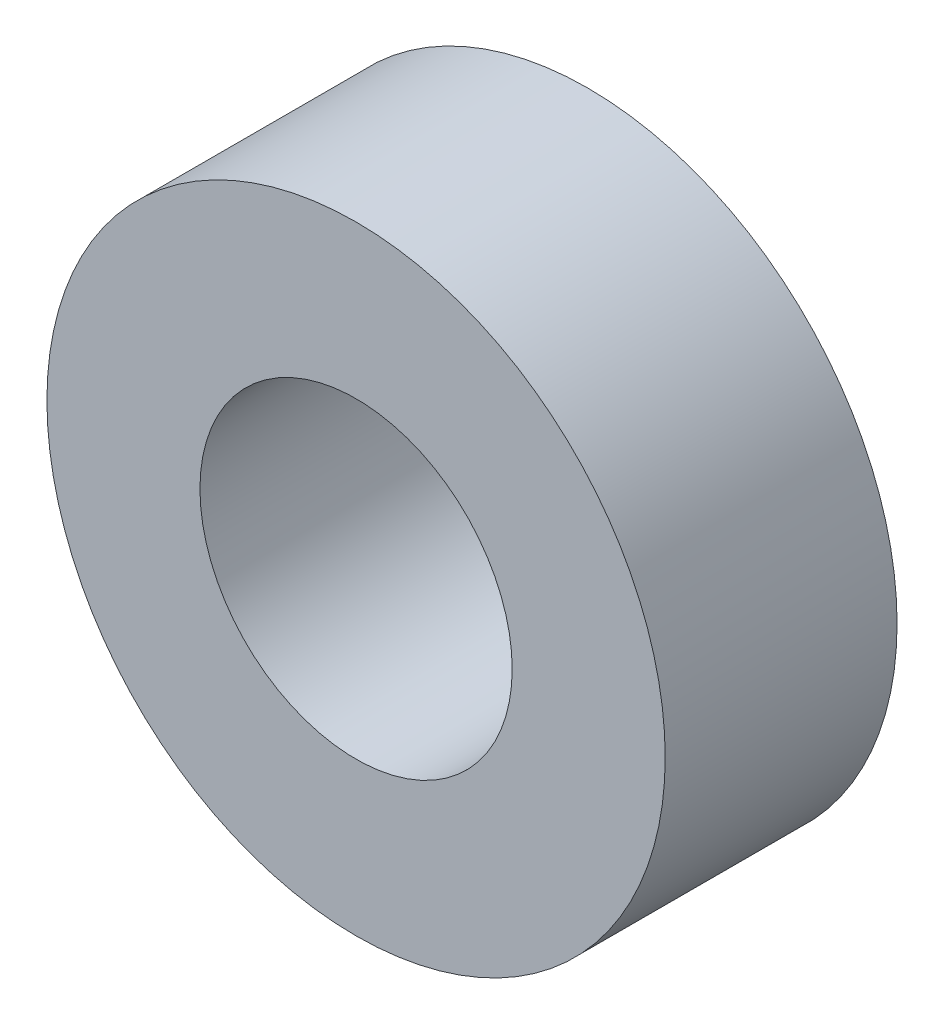
ISO-10303-21;
HEADER;
FILE_DESCRIPTION(('STEP AP214'),'2;1');
FILE_NAME('part.step','',(''),(''),'','','');
FILE_SCHEMA(('AUTOMOTIVE_DESIGN { 1 0 10303 214 1 1 1 1 }'));
ENDSEC;
DATA;
#1=APPLICATION_CONTEXT('core data for automotive mechanical design processes');
#2=APPLICATION_PROTOCOL_DEFINITION('international standard','automotive_design',2000,#1);
#3=PRODUCT_CONTEXT('',#1,'mechanical');
#4=PRODUCT('Part','Part','',(#3));
#5=PRODUCT_RELATED_PRODUCT_CATEGORY('part','',(#4));
#6=PRODUCT_DEFINITION_FORMATION('','',#4);
#7=PRODUCT_DEFINITION_CONTEXT('part definition',#1,'design');
#8=PRODUCT_DEFINITION('design','',#6,#7);
#9=PRODUCT_DEFINITION_SHAPE('','',#8);
#10=(LENGTH_UNIT() NAMED_UNIT(*) SI_UNIT(.MILLI.,.METRE.));
#11=(NAMED_UNIT(*) PLANE_ANGLE_UNIT() SI_UNIT($,.RADIAN.));
#12=(NAMED_UNIT(*) SI_UNIT($,.STERADIAN.) SOLID_ANGLE_UNIT());
#13=UNCERTAINTY_MEASURE_WITH_UNIT(LENGTH_MEASURE(1.E-05),#10,'distance_accuracy_value','');
#14=(GEOMETRIC_REPRESENTATION_CONTEXT(3) GLOBAL_UNCERTAINTY_ASSIGNED_CONTEXT((#13)) GLOBAL_UNIT_ASSIGNED_CONTEXT((#10,
#11,#12)) REPRESENTATION_CONTEXT('',''));
#15=CARTESIAN_POINT('',(0.,0.,0.));
#16=DIRECTION('',(0.,0.,1.));
#17=DIRECTION('',(1.,0.,0.));
#18=AXIS2_PLACEMENT_3D('',#15,#16,#17);
#19=CARTESIAN_POINT('',(0.,0.,4.7625));
#20=DIRECTION('',(0.,0.,1.));
#21=DIRECTION('',(1.,0.,0.));
#22=AXIS2_PLACEMENT_3D('',#19,#20,#21);
#23=PLANE('',#22);
#24=CARTESIAN_POINT('',(0.,0.,4.7625));
#25=DIRECTION('',(0.,0.,1.));
#26=DIRECTION('',(1.,0.,0.));
#27=AXIS2_PLACEMENT_3D('',#24,#25,#26);
#28=CIRCLE('',#27,12.7);
#29=CARTESIAN_POINT('',(12.7,0.,4.7625));
#30=VERTEX_POINT('',#29);
#31=EDGE_CURVE('E10',#30,#30,#28,.T.);
#32=ORIENTED_EDGE('',*,*,#31,.T.);
#33=EDGE_LOOP('',(#32));
#34=FACE_BOUND('',#33,.T.);
#35=CARTESIAN_POINT('',(0.,0.,4.7625));
#36=DIRECTION('',(0.,0.,1.));
#37=DIRECTION('',(1.,0.,0.));
#38=AXIS2_PLACEMENT_3D('',#35,#36,#37);
#39=CIRCLE('',#38,6.4135);
#40=CARTESIAN_POINT('',(6.4135,0.,4.7625));
#41=VERTEX_POINT('',#40);
#42=EDGE_CURVE('E45',#41,#41,#39,.T.);
#43=ORIENTED_EDGE('',*,*,#42,.F.);
#44=EDGE_LOOP('',(#43));
#45=FACE_BOUND('',#44,.T.);
#46=ADVANCED_FACE('F34',(#34,#45),#23,.T.);
#47=CARTESIAN_POINT('',(0.,0.,-4.7625));
#48=DIRECTION('',(0.,0.,1.));
#49=DIRECTION('',(1.,0.,0.));
#50=AXIS2_PLACEMENT_3D('',#47,#48,#49);
#51=PLANE('',#50);
#52=CARTESIAN_POINT('',(0.,0.,-4.7625));
#53=DIRECTION('',(0.,0.,1.));
#54=DIRECTION('',(1.,0.,0.));
#55=AXIS2_PLACEMENT_3D('',#52,#53,#54);
#56=CIRCLE('',#55,12.7);
#57=CARTESIAN_POINT('',(12.7,0.,-4.7625));
#58=VERTEX_POINT('',#57);
#59=EDGE_CURVE('E38',#58,#58,#56,.T.);
#60=ORIENTED_EDGE('',*,*,#59,.F.);
#61=EDGE_LOOP('',(#60));
#62=FACE_BOUND('',#61,.T.);
#63=CARTESIAN_POINT('',(0.,0.,-4.7625));
#64=DIRECTION('',(0.,0.,1.));
#65=DIRECTION('',(1.,0.,0.));
#66=AXIS2_PLACEMENT_3D('',#63,#64,#65);
#67=CIRCLE('',#66,6.4135);
#68=CARTESIAN_POINT('',(6.4135,0.,-4.7625));
#69=VERTEX_POINT('',#68);
#70=EDGE_CURVE('E47',#69,#69,#67,.T.);
#71=ORIENTED_EDGE('',*,*,#70,.T.);
#72=EDGE_LOOP('',(#71));
#73=FACE_BOUND('',#72,.T.);
#74=ADVANCED_FACE('F57',(#62,#73),#51,.F.);
#75=CARTESIAN_POINT('',(0.,0.,4.7625));
#76=DIRECTION('',(0.,0.,-1.));
#77=DIRECTION('',(-1.,0.,0.));
#78=AXIS2_PLACEMENT_3D('',#75,#76,#77);
#79=CYLINDRICAL_SURFACE('',#78,12.7);
#80=ORIENTED_EDGE('',*,*,#31,.F.);
#81=EDGE_LOOP('',(#80));
#82=FACE_BOUND('',#81,.T.);
#83=ORIENTED_EDGE('',*,*,#59,.T.);
#84=EDGE_LOOP('',(#83));
#85=FACE_BOUND('',#84,.T.);
#86=ADVANCED_FACE('F36',(#82,#85),#79,.T.);
#87=CARTESIAN_POINT('',(0.,0.,4.7625));
#88=DIRECTION('',(0.,0.,-1.));
#89=DIRECTION('',(-1.,0.,0.));
#90=AXIS2_PLACEMENT_3D('',#87,#88,#89);
#91=CYLINDRICAL_SURFACE('',#90,6.4135);
#92=ORIENTED_EDGE('',*,*,#42,.T.);
#93=EDGE_LOOP('',(#92));
#94=FACE_BOUND('',#93,.T.);
#95=ORIENTED_EDGE('',*,*,#70,.F.);
#96=EDGE_LOOP('',(#95));
#97=FACE_BOUND('',#96,.T.);
#98=ADVANCED_FACE('F53',(#94,#97),#91,.F.);
#99=CLOSED_SHELL('',(#46,#74,#86,#98));
#100=MANIFOLD_SOLID_BREP('B2',#99);
#101=ADVANCED_BREP_SHAPE_REPRESENTATION('',(#18,#100),#14);
#102=SHAPE_DEFINITION_REPRESENTATION(#9,#101);
ENDSEC;
END-ISO-10303-21;
